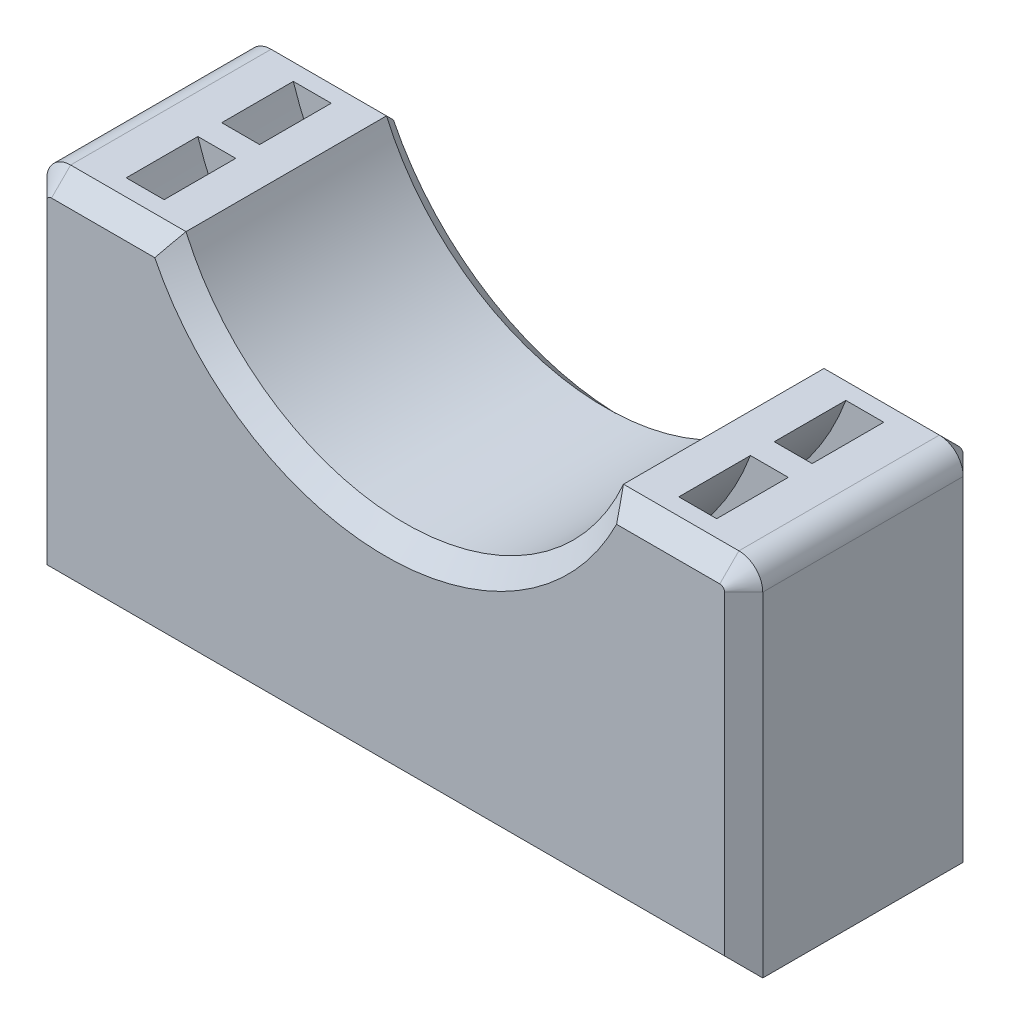
ISO-10303-21;
HEADER;
FILE_DESCRIPTION(('STEP AP214'),'2;1');
FILE_NAME('part.step','',(''),(''),'','','');
FILE_SCHEMA(('AUTOMOTIVE_DESIGN { 1 0 10303 214 1 1 1 1 }'));
ENDSEC;
DATA;
#1=APPLICATION_CONTEXT('core data for automotive mechanical design processes');
#2=APPLICATION_PROTOCOL_DEFINITION('international standard','automotive_design',2000,#1);
#3=PRODUCT_CONTEXT('',#1,'mechanical');
#4=PRODUCT('Part','Part','',(#3));
#5=PRODUCT_RELATED_PRODUCT_CATEGORY('part','',(#4));
#6=PRODUCT_DEFINITION_FORMATION('','',#4);
#7=PRODUCT_DEFINITION_CONTEXT('part definition',#1,'design');
#8=PRODUCT_DEFINITION('design','',#6,#7);
#9=PRODUCT_DEFINITION_SHAPE('','',#8);
#10=(LENGTH_UNIT() NAMED_UNIT(*) SI_UNIT(.MILLI.,.METRE.));
#11=(NAMED_UNIT(*) PLANE_ANGLE_UNIT() SI_UNIT($,.RADIAN.));
#12=(NAMED_UNIT(*) SI_UNIT($,.STERADIAN.) SOLID_ANGLE_UNIT());
#13=UNCERTAINTY_MEASURE_WITH_UNIT(LENGTH_MEASURE(1.E-05),#10,'distance_accuracy_value','');
#14=(GEOMETRIC_REPRESENTATION_CONTEXT(3) GLOBAL_UNCERTAINTY_ASSIGNED_CONTEXT((#13)) GLOBAL_UNIT_ASSIGNED_CONTEXT((#10,
#11,#12)) REPRESENTATION_CONTEXT('',''));
#15=CARTESIAN_POINT('',(0.,0.,0.));
#16=DIRECTION('',(0.,0.,1.));
#17=DIRECTION('',(1.,0.,0.));
#18=AXIS2_PLACEMENT_3D('',#15,#16,#17);
#19=CARTESIAN_POINT('',(0.,7.5,10.));
#20=DIRECTION('',(0.,1.,0.));
#21=DIRECTION('',(0.,0.,1.));
#22=AXIS2_PLACEMENT_3D('',#19,#20,#21);
#23=PLANE('',#22);
#24=DIRECTION('',(0.,0.,-1.));
#25=VECTOR('',#24,1.);
#26=CARTESIAN_POINT('',(-9.16515138991168,7.5,10.));
#27=LINE('',#26,#25);
#28=CARTESIAN_POINT('',(-9.16515138991168,7.5,9.19999999999999));
#29=VERTEX_POINT('',#28);
#30=CARTESIAN_POINT('',(-9.16515138991168,7.5,0.799999999999995));
#31=VERTEX_POINT('',#30);
#32=EDGE_CURVE('E215',#29,#31,#27,.T.);
#33=ORIENTED_EDGE('',*,*,#32,.T.);
#34=DIRECTION('',(-1.,0.,0.));
#35=VECTOR('',#34,1.);
#36=CARTESIAN_POINT('',(-14.,7.5,0.799999999999995));
#37=LINE('',#36,#35);
#38=CARTESIAN_POINT('',(-14.,7.5,0.799999999999995));
#39=VERTEX_POINT('',#38);
#40=EDGE_CURVE('E283',#31,#39,#37,.T.);
#41=ORIENTED_EDGE('',*,*,#40,.T.);
#42=DIRECTION('',(0.,0.,-1.));
#43=VECTOR('',#42,1.);
#44=CARTESIAN_POINT('',(-14.,7.5,10.));
#45=LINE('',#44,#43);
#46=CARTESIAN_POINT('',(-14.,7.5,9.19999999999999));
#47=VERTEX_POINT('',#46);
#48=EDGE_CURVE('E256',#39,#47,#45,.F.);
#49=ORIENTED_EDGE('',*,*,#48,.T.);
#50=DIRECTION('',(1.,0.,0.));
#51=VECTOR('',#50,1.);
#52=CARTESIAN_POINT('',(0.,7.5,9.19999999999999));
#53=LINE('',#52,#51);
#54=EDGE_CURVE('E281',#47,#29,#53,.T.);
#55=ORIENTED_EDGE('',*,*,#54,.T.);
#56=EDGE_LOOP('',(#33,#41,#49,#55));
#57=FACE_BOUND('',#56,.T.);
#58=DIRECTION('',(0.,0.,-1.));
#59=VECTOR('',#58,1.);
#60=CARTESIAN_POINT('',(-10.7819293264239,7.5,0.));
#61=LINE('',#60,#59);
#62=CARTESIAN_POINT('',(-10.7819293264239,7.5,1.5));
#63=VERTEX_POINT('',#62);
#64=CARTESIAN_POINT('',(-10.7819293264239,7.5,4.5));
#65=VERTEX_POINT('',#64);
#66=EDGE_CURVE('E520',#63,#65,#61,.F.);
#67=ORIENTED_EDGE('',*,*,#66,.T.);
#68=DIRECTION('',(-1.,0.,0.));
#69=VECTOR('',#68,1.);
#70=CARTESIAN_POINT('',(0.,7.5,4.5));
#71=LINE('',#70,#69);
#72=CARTESIAN_POINT('',(-12.369316876853,7.5,4.5));
#73=VERTEX_POINT('',#72);
#74=EDGE_CURVE('E223',#65,#73,#71,.T.);
#75=ORIENTED_EDGE('',*,*,#74,.T.);
#76=DIRECTION('',(0.,0.,-1.));
#77=VECTOR('',#76,1.);
#78=CARTESIAN_POINT('',(-12.369316876853,7.5,0.));
#79=LINE('',#78,#77);
#80=CARTESIAN_POINT('',(-12.369316876853,7.5,1.5));
#81=VERTEX_POINT('',#80);
#82=EDGE_CURVE('E524',#73,#81,#79,.T.);
#83=ORIENTED_EDGE('',*,*,#82,.T.);
#84=DIRECTION('',(1.,0.,0.));
#85=VECTOR('',#84,1.);
#86=CARTESIAN_POINT('',(0.,7.5,1.5));
#87=LINE('',#86,#85);
#88=EDGE_CURVE('E511',#81,#63,#87,.T.);
#89=ORIENTED_EDGE('',*,*,#88,.T.);
#90=EDGE_LOOP('',(#67,#75,#83,#89));
#91=FACE_BOUND('',#90,.T.);
#92=DIRECTION('',(0.,0.,-1.));
#93=VECTOR('',#92,1.);
#94=CARTESIAN_POINT('',(-10.7819293264239,7.5,0.));
#95=LINE('',#94,#93);
#96=CARTESIAN_POINT('',(-10.7819293264239,7.5,5.50000000000001));
#97=VERTEX_POINT('',#96);
#98=CARTESIAN_POINT('',(-10.7819293264239,7.5,8.50000000000001));
#99=VERTEX_POINT('',#98);
#100=EDGE_CURVE('E527',#97,#99,#95,.F.);
#101=ORIENTED_EDGE('',*,*,#100,.T.);
#102=DIRECTION('',(-1.,0.,0.));
#103=VECTOR('',#102,1.);
#104=CARTESIAN_POINT('',(0.,7.5,8.50000000000001));
#105=LINE('',#104,#103);
#106=CARTESIAN_POINT('',(-12.369316876853,7.5,8.50000000000001));
#107=VERTEX_POINT('',#106);
#108=EDGE_CURVE('E536',#99,#107,#105,.T.);
#109=ORIENTED_EDGE('',*,*,#108,.T.);
#110=DIRECTION('',(0.,0.,-1.));
#111=VECTOR('',#110,1.);
#112=CARTESIAN_POINT('',(-12.369316876853,7.5,0.));
#113=LINE('',#112,#111);
#114=CARTESIAN_POINT('',(-12.369316876853,7.5,5.50000000000001));
#115=VERTEX_POINT('',#114);
#116=EDGE_CURVE('E533',#107,#115,#113,.T.);
#117=ORIENTED_EDGE('',*,*,#116,.T.);
#118=DIRECTION('',(1.,0.,0.));
#119=VECTOR('',#118,1.);
#120=CARTESIAN_POINT('',(0.,7.5,5.50000000000001));
#121=LINE('',#120,#119);
#122=EDGE_CURVE('E530',#115,#97,#121,.T.);
#123=ORIENTED_EDGE('',*,*,#122,.T.);
#124=EDGE_LOOP('',(#101,#109,#117,#123));
#125=FACE_BOUND('',#124,.T.);
#126=ADVANCED_FACE('F37',(#57,#91,#125),#23,.T.);
#127=DIRECTION('',(0.,0.,-1.));
#128=VECTOR('',#127,1.);
#129=CARTESIAN_POINT('',(14.,7.5,0.));
#130=LINE('',#129,#128);
#131=CARTESIAN_POINT('',(14.,7.5,9.19999999999999));
#132=VERTEX_POINT('',#131);
#133=CARTESIAN_POINT('',(14.,7.5,0.799999999999995));
#134=VERTEX_POINT('',#133);
#135=EDGE_CURVE('E247',#132,#134,#130,.T.);
#136=ORIENTED_EDGE('',*,*,#135,.T.);
#137=DIRECTION('',(-1.,0.,0.));
#138=VECTOR('',#137,1.);
#139=CARTESIAN_POINT('',(9.16515138991168,7.5,0.799999999999995));
#140=LINE('',#139,#138);
#141=CARTESIAN_POINT('',(9.16515138991168,7.5,0.799999999999995));
#142=VERTEX_POINT('',#141);
#143=EDGE_CURVE('E308',#134,#142,#140,.T.);
#144=ORIENTED_EDGE('',*,*,#143,.T.);
#145=DIRECTION('',(0.,0.,-1.));
#146=VECTOR('',#145,1.);
#147=CARTESIAN_POINT('',(9.16515138991168,7.5,10.));
#148=LINE('',#147,#146);
#149=CARTESIAN_POINT('',(9.16515138991168,7.5,9.19999999999999));
#150=VERTEX_POINT('',#149);
#151=EDGE_CURVE('E496',#150,#142,#148,.T.);
#152=ORIENTED_EDGE('',*,*,#151,.F.);
#153=DIRECTION('',(1.,0.,0.));
#154=VECTOR('',#153,1.);
#155=CARTESIAN_POINT('',(0.,7.5,9.19999999999999));
#156=LINE('',#155,#154);
#157=EDGE_CURVE('E306',#150,#132,#156,.T.);
#158=ORIENTED_EDGE('',*,*,#157,.T.);
#159=EDGE_LOOP('',(#136,#144,#152,#158));
#160=FACE_BOUND('',#159,.T.);
#161=DIRECTION('',(0.,0.,-1.));
#162=VECTOR('',#161,1.);
#163=CARTESIAN_POINT('',(12.369316876853,7.5,0.));
#164=LINE('',#163,#162);
#165=CARTESIAN_POINT('',(12.369316876853,7.5,1.5));
#166=VERTEX_POINT('',#165);
#167=CARTESIAN_POINT('',(12.369316876853,7.5,4.5));
#168=VERTEX_POINT('',#167);
#169=EDGE_CURVE('E230',#166,#168,#164,.F.);
#170=ORIENTED_EDGE('',*,*,#169,.T.);
#171=DIRECTION('',(-1.,0.,0.));
#172=VECTOR('',#171,1.);
#173=CARTESIAN_POINT('',(0.,7.5,4.5));
#174=LINE('',#173,#172);
#175=CARTESIAN_POINT('',(10.7819293264239,7.5,4.5));
#176=VERTEX_POINT('',#175);
#177=EDGE_CURVE('E220',#168,#176,#174,.T.);
#178=ORIENTED_EDGE('',*,*,#177,.T.);
#179=DIRECTION('',(0.,0.,-1.));
#180=VECTOR('',#179,1.);
#181=CARTESIAN_POINT('',(10.7819293264239,7.5,0.));
#182=LINE('',#181,#180);
#183=CARTESIAN_POINT('',(10.7819293264239,7.5,1.5));
#184=VERTEX_POINT('',#183);
#185=EDGE_CURVE('E203',#176,#184,#182,.T.);
#186=ORIENTED_EDGE('',*,*,#185,.T.);
#187=DIRECTION('',(1.,0.,0.));
#188=VECTOR('',#187,1.);
#189=CARTESIAN_POINT('',(0.,7.5,1.5));
#190=LINE('',#189,#188);
#191=EDGE_CURVE('E214',#184,#166,#190,.T.);
#192=ORIENTED_EDGE('',*,*,#191,.T.);
#193=EDGE_LOOP('',(#170,#178,#186,#192));
#194=FACE_BOUND('',#193,.T.);
#195=DIRECTION('',(0.,0.,-1.));
#196=VECTOR('',#195,1.);
#197=CARTESIAN_POINT('',(12.369316876853,7.5,0.));
#198=LINE('',#197,#196);
#199=CARTESIAN_POINT('',(12.369316876853,7.5,5.50000000000001));
#200=VERTEX_POINT('',#199);
#201=CARTESIAN_POINT('',(12.369316876853,7.5,8.50000000000001));
#202=VERTEX_POINT('',#201);
#203=EDGE_CURVE('E241',#200,#202,#198,.F.);
#204=ORIENTED_EDGE('',*,*,#203,.T.);
#205=DIRECTION('',(-1.,0.,0.));
#206=VECTOR('',#205,1.);
#207=CARTESIAN_POINT('',(0.,7.5,8.50000000000001));
#208=LINE('',#207,#206);
#209=CARTESIAN_POINT('',(10.7819293264239,7.5,8.5));
#210=VERTEX_POINT('',#209);
#211=EDGE_CURVE('E244',#202,#210,#208,.T.);
#212=ORIENTED_EDGE('',*,*,#211,.T.);
#213=DIRECTION('',(0.,0.,-1.));
#214=VECTOR('',#213,1.);
#215=CARTESIAN_POINT('',(10.7819293264239,7.5,0.));
#216=LINE('',#215,#214);
#217=CARTESIAN_POINT('',(10.7819293264239,7.5,5.50000000000001));
#218=VERTEX_POINT('',#217);
#219=EDGE_CURVE('E231',#210,#218,#216,.T.);
#220=ORIENTED_EDGE('',*,*,#219,.T.);
#221=DIRECTION('',(1.,0.,0.));
#222=VECTOR('',#221,1.);
#223=CARTESIAN_POINT('',(0.,7.5,5.50000000000001));
#224=LINE('',#223,#222);
#225=EDGE_CURVE('E234',#218,#200,#224,.T.);
#226=ORIENTED_EDGE('',*,*,#225,.T.);
#227=EDGE_LOOP('',(#204,#212,#220,#226));
#228=FACE_BOUND('',#227,.T.);
#229=ADVANCED_FACE('F228',(#160,#194,#228),#23,.T.);
#230=CARTESIAN_POINT('',(0.,11.5,10.));
#231=DIRECTION('',(0.,0.,-1.));
#232=DIRECTION('',(-1.,0.,0.));
#233=AXIS2_PLACEMENT_3D('',#230,#231,#232);
#234=CYLINDRICAL_SURFACE('',#233,10.);
#235=ORIENTED_EDGE('',*,*,#151,.T.);
#236=CARTESIAN_POINT('',(0.,11.5,0.799999999999995));
#237=DIRECTION('',(0.,0.,1.));
#238=DIRECTION('',(1.,0.,0.));
#239=AXIS2_PLACEMENT_3D('',#236,#237,#238);
#240=CIRCLE('',#239,10.);
#241=EDGE_CURVE('E278',#142,#31,#240,.F.);
#242=ORIENTED_EDGE('',*,*,#241,.T.);
#243=ORIENTED_EDGE('',*,*,#32,.F.);
#244=CARTESIAN_POINT('',(0.,11.5,9.19999999999999));
#245=DIRECTION('',(0.,0.,1.));
#246=DIRECTION('',(1.,0.,0.));
#247=AXIS2_PLACEMENT_3D('',#244,#245,#246);
#248=CIRCLE('',#247,10.);
#249=EDGE_CURVE('E276',#29,#150,#248,.T.);
#250=ORIENTED_EDGE('',*,*,#249,.T.);
#251=EDGE_LOOP('',(#235,#242,#243,#250));
#252=FACE_BOUND('',#251,.T.);
#253=ADVANCED_FACE('F493',(#252),#234,.F.);
#254=CARTESIAN_POINT('',(-15.,0.,10.));
#255=DIRECTION('',(-1.,0.,0.));
#256=DIRECTION('',(0.,0.,1.));
#257=AXIS2_PLACEMENT_3D('',#254,#255,#256);
#258=PLANE('',#257);
#259=DIRECTION('',(0.,0.,-1.));
#260=VECTOR('',#259,1.);
#261=CARTESIAN_POINT('',(-15.,6.5,10.));
#262=LINE('',#261,#260);
#263=CARTESIAN_POINT('',(-15.,6.5,9.19999999999999));
#264=VERTEX_POINT('',#263);
#265=CARTESIAN_POINT('',(-15.,6.5,0.799999999999995));
#266=VERTEX_POINT('',#265);
#267=EDGE_CURVE('E253',#264,#266,#262,.T.);
#268=ORIENTED_EDGE('',*,*,#267,.T.);
#269=DIRECTION('',(0.,-1.,0.));
#270=VECTOR('',#269,1.);
#271=CARTESIAN_POINT('',(-15.,-7.5,0.799999999999995));
#272=LINE('',#271,#270);
#273=CARTESIAN_POINT('',(-15.,-7.5,0.799999999999995));
#274=VERTEX_POINT('',#273);
#275=EDGE_CURVE('E291',#266,#274,#272,.T.);
#276=ORIENTED_EDGE('',*,*,#275,.T.);
#277=DIRECTION('',(0.,0.,-1.));
#278=VECTOR('',#277,1.);
#279=CARTESIAN_POINT('',(-15.,-7.5,10.));
#280=LINE('',#279,#278);
#281=CARTESIAN_POINT('',(-15.,-7.5,9.19999999999999));
#282=VERTEX_POINT('',#281);
#283=EDGE_CURVE('E499',#282,#274,#280,.T.);
#284=ORIENTED_EDGE('',*,*,#283,.F.);
#285=DIRECTION('',(0.,1.,0.));
#286=VECTOR('',#285,1.);
#287=CARTESIAN_POINT('',(-15.,0.,9.19999999999999));
#288=LINE('',#287,#286);
#289=EDGE_CURVE('E289',#282,#264,#288,.T.);
#290=ORIENTED_EDGE('',*,*,#289,.T.);
#291=EDGE_LOOP('',(#268,#276,#284,#290));
#292=FACE_BOUND('',#291,.T.);
#293=ADVANCED_FACE('F586',(#292),#258,.T.);
#294=CARTESIAN_POINT('',(0.,-7.5,10.));
#295=DIRECTION('',(0.,1.,0.));
#296=DIRECTION('',(0.,0.,1.));
#297=AXIS2_PLACEMENT_3D('',#294,#295,#296);
#298=PLANE('',#297);
#299=CARTESIAN_POINT('',(-8.,-7.5,5.));
#300=DIRECTION('',(0.,-1.,0.));
#301=DIRECTION('',(0.,0.,-1.));
#302=AXIS2_PLACEMENT_3D('',#299,#300,#301);
#303=CIRCLE('',#302,1.4);
#304=CARTESIAN_POINT('',(-8.,-7.5,3.6));
#305=VERTEX_POINT('',#304);
#306=EDGE_CURVE('E543',#305,#305,#303,.T.);
#307=ORIENTED_EDGE('',*,*,#306,.F.);
#308=EDGE_LOOP('',(#307));
#309=FACE_BOUND('',#308,.T.);
#310=CARTESIAN_POINT('',(8.,-7.5,5.));
#311=DIRECTION('',(0.,-1.,0.));
#312=DIRECTION('',(0.,0.,1.));
#313=AXIS2_PLACEMENT_3D('',#310,#311,#312);
#314=CIRCLE('',#313,1.4);
#315=CARTESIAN_POINT('',(8.,-7.5,6.4));
#316=VERTEX_POINT('',#315);
#317=EDGE_CURVE('E539',#316,#316,#314,.T.);
#318=ORIENTED_EDGE('',*,*,#317,.F.);
#319=EDGE_LOOP('',(#318));
#320=FACE_BOUND('',#319,.T.);
#321=ORIENTED_EDGE('',*,*,#283,.T.);
#322=DIRECTION('',(1.,0.,0.));
#323=VECTOR('',#322,1.);
#324=CARTESIAN_POINT('',(0.,-7.5,0.799999999999995));
#325=LINE('',#324,#323);
#326=CARTESIAN_POINT('',(15.,-7.5,0.799999999999995));
#327=VERTEX_POINT('',#326);
#328=EDGE_CURVE('E296',#274,#327,#325,.T.);
#329=ORIENTED_EDGE('',*,*,#328,.T.);
#330=DIRECTION('',(0.,0.,-1.));
#331=VECTOR('',#330,1.);
#332=CARTESIAN_POINT('',(15.,-7.5,10.));
#333=LINE('',#332,#331);
#334=CARTESIAN_POINT('',(15.,-7.5,9.19999999999999));
#335=VERTEX_POINT('',#334);
#336=EDGE_CURVE('E502',#335,#327,#333,.T.);
#337=ORIENTED_EDGE('',*,*,#336,.F.);
#338=DIRECTION('',(-1.,0.,0.));
#339=VECTOR('',#338,1.);
#340=CARTESIAN_POINT('',(-15.,-7.5,9.19999999999999));
#341=LINE('',#340,#339);
#342=EDGE_CURVE('E293',#335,#282,#341,.T.);
#343=ORIENTED_EDGE('',*,*,#342,.T.);
#344=EDGE_LOOP('',(#321,#329,#337,#343));
#345=FACE_BOUND('',#344,.T.);
#346=ADVANCED_FACE('F584',(#309,#320,#345),#298,.F.);
#347=CARTESIAN_POINT('',(15.,0.,10.));
#348=DIRECTION('',(-1.,0.,0.));
#349=DIRECTION('',(0.,0.,1.));
#350=AXIS2_PLACEMENT_3D('',#347,#348,#349);
#351=PLANE('',#350);
#352=ORIENTED_EDGE('',*,*,#336,.T.);
#353=DIRECTION('',(0.,1.,0.));
#354=VECTOR('',#353,1.);
#355=CARTESIAN_POINT('',(15.,0.,0.799999999999995));
#356=LINE('',#355,#354);
#357=CARTESIAN_POINT('',(15.,6.5,0.799999999999995));
#358=VERTEX_POINT('',#357);
#359=EDGE_CURVE('E300',#327,#358,#356,.T.);
#360=ORIENTED_EDGE('',*,*,#359,.T.);
#361=DIRECTION('',(0.,0.,-1.));
#362=VECTOR('',#361,1.);
#363=CARTESIAN_POINT('',(15.,6.5,10.));
#364=LINE('',#363,#362);
#365=CARTESIAN_POINT('',(15.,6.5,9.19999999999999));
#366=VERTEX_POINT('',#365);
#367=EDGE_CURVE('E250',#358,#366,#364,.F.);
#368=ORIENTED_EDGE('',*,*,#367,.T.);
#369=DIRECTION('',(0.,-1.,0.));
#370=VECTOR('',#369,1.);
#371=CARTESIAN_POINT('',(15.,-7.5,9.19999999999999));
#372=LINE('',#371,#370);
#373=EDGE_CURVE('E298',#366,#335,#372,.T.);
#374=ORIENTED_EDGE('',*,*,#373,.T.);
#375=EDGE_LOOP('',(#352,#360,#368,#374));
#376=FACE_BOUND('',#375,.T.);
#377=ADVANCED_FACE('F555',(#376),#351,.F.);
#378=CARTESIAN_POINT('',(0.,0.,10.));
#379=DIRECTION('',(0.,0.,1.));
#380=DIRECTION('',(1.,0.,0.));
#381=AXIS2_PLACEMENT_3D('',#378,#379,#380);
#382=PLANE('',#381);
#383=DIRECTION('',(0.,-1.,0.));
#384=VECTOR('',#383,1.);
#385=CARTESIAN_POINT('',(-14.2,0.,10.));
#386=LINE('',#385,#384);
#387=CARTESIAN_POINT('',(-14.2,6.5,10.));
#388=VERTEX_POINT('',#387);
#389=CARTESIAN_POINT('',(-14.2,-6.7,10.));
#390=VERTEX_POINT('',#389);
#391=EDGE_CURVE('E52',#388,#390,#386,.T.);
#392=ORIENTED_EDGE('',*,*,#391,.T.);
#393=DIRECTION('',(1.,0.,0.));
#394=VECTOR('',#393,1.);
#395=CARTESIAN_POINT('',(15.,-6.7,10.));
#396=LINE('',#395,#394);
#397=CARTESIAN_POINT('',(14.2,-6.7,10.));
#398=VERTEX_POINT('',#397);
#399=EDGE_CURVE('E11',#390,#398,#396,.T.);
#400=ORIENTED_EDGE('',*,*,#399,.T.);
#401=DIRECTION('',(0.,1.,0.));
#402=VECTOR('',#401,1.);
#403=CARTESIAN_POINT('',(14.2,6.5,10.));
#404=LINE('',#403,#402);
#405=CARTESIAN_POINT('',(14.2,6.5,10.));
#406=VERTEX_POINT('',#405);
#407=EDGE_CURVE('E310',#398,#406,#404,.T.);
#408=ORIENTED_EDGE('',*,*,#407,.T.);
#409=CARTESIAN_POINT('',(14.,6.5,10.));
#410=DIRECTION('',(0.,0.,1.));
#411=DIRECTION('',(1.,0.,0.));
#412=AXIS2_PLACEMENT_3D('',#409,#410,#411);
#413=CIRCLE('',#412,0.199999999999999);
#414=CARTESIAN_POINT('',(14.,6.7,10.));
#415=VERTEX_POINT('',#414);
#416=EDGE_CURVE('E312',#406,#415,#413,.T.);
#417=ORIENTED_EDGE('',*,*,#416,.T.);
#418=DIRECTION('',(-1.,0.,0.));
#419=VECTOR('',#418,1.);
#420=CARTESIAN_POINT('',(0.,6.7,10.));
#421=LINE('',#420,#419);
#422=CARTESIAN_POINT('',(9.67470929795827,6.7,10.));
#423=VERTEX_POINT('',#422);
#424=EDGE_CURVE('E314',#415,#423,#421,.T.);
#425=ORIENTED_EDGE('',*,*,#424,.T.);
#426=CARTESIAN_POINT('',(0.,11.5,10.));
#427=DIRECTION('',(0.,0.,1.));
#428=DIRECTION('',(1.,0.,0.));
#429=AXIS2_PLACEMENT_3D('',#426,#427,#428);
#430=CIRCLE('',#429,10.8);
#431=CARTESIAN_POINT('',(-9.67470929795827,6.70000000000002,10.));
#432=VERTEX_POINT('',#431);
#433=EDGE_CURVE('E316',#423,#432,#430,.F.);
#434=ORIENTED_EDGE('',*,*,#433,.T.);
#435=DIRECTION('',(-1.,0.,0.));
#436=VECTOR('',#435,1.);
#437=CARTESIAN_POINT('',(0.,6.7,10.));
#438=LINE('',#437,#436);
#439=CARTESIAN_POINT('',(-14.,6.7,10.));
#440=VERTEX_POINT('',#439);
#441=EDGE_CURVE('E318',#432,#440,#438,.T.);
#442=ORIENTED_EDGE('',*,*,#441,.T.);
#443=CARTESIAN_POINT('',(-14.,6.5,10.));
#444=DIRECTION('',(0.,0.,1.));
#445=DIRECTION('',(1.,0.,0.));
#446=AXIS2_PLACEMENT_3D('',#443,#444,#445);
#447=CIRCLE('',#446,0.199999999999997);
#448=EDGE_CURVE('E63',#440,#388,#447,.T.);
#449=ORIENTED_EDGE('',*,*,#448,.T.);
#450=EDGE_LOOP('',(#392,#400,#408,#417,#425,#434,#442,#449));
#451=FACE_BOUND('',#450,.T.);
#452=ADVANCED_FACE('F609',(#451),#382,.T.);
#453=CARTESIAN_POINT('',(0.,0.,0.));
#454=DIRECTION('',(0.,0.,1.));
#455=DIRECTION('',(1.,0.,0.));
#456=AXIS2_PLACEMENT_3D('',#453,#454,#455);
#457=PLANE('',#456);
#458=DIRECTION('',(1.,0.,0.));
#459=VECTOR('',#458,1.);
#460=CARTESIAN_POINT('',(-9.16515138991168,6.7,0.));
#461=LINE('',#460,#459);
#462=CARTESIAN_POINT('',(-14.,6.7,0.));
#463=VERTEX_POINT('',#462);
#464=CARTESIAN_POINT('',(-9.67470929795827,6.7,0.));
#465=VERTEX_POINT('',#464);
#466=EDGE_CURVE('E271',#463,#465,#461,.T.);
#467=ORIENTED_EDGE('',*,*,#466,.T.);
#468=CARTESIAN_POINT('',(0.,11.5,0.));
#469=DIRECTION('',(0.,0.,1.));
#470=DIRECTION('',(1.,0.,0.));
#471=AXIS2_PLACEMENT_3D('',#468,#469,#470);
#472=CIRCLE('',#471,10.8);
#473=CARTESIAN_POINT('',(9.67470929795827,6.7,0.));
#474=VERTEX_POINT('',#473);
#475=EDGE_CURVE('E273',#465,#474,#472,.T.);
#476=ORIENTED_EDGE('',*,*,#475,.T.);
#477=DIRECTION('',(1.,0.,0.));
#478=VECTOR('',#477,1.);
#479=CARTESIAN_POINT('',(14.,6.7,0.));
#480=LINE('',#479,#478);
#481=CARTESIAN_POINT('',(14.,6.7,0.));
#482=VERTEX_POINT('',#481);
#483=EDGE_CURVE('E259',#474,#482,#480,.T.);
#484=ORIENTED_EDGE('',*,*,#483,.T.);
#485=CARTESIAN_POINT('',(14.,6.5,0.));
#486=DIRECTION('',(0.,0.,1.));
#487=DIRECTION('',(1.,0.,0.));
#488=AXIS2_PLACEMENT_3D('',#485,#486,#487);
#489=CIRCLE('',#488,0.200000000000002);
#490=CARTESIAN_POINT('',(14.2,6.5,0.));
#491=VERTEX_POINT('',#490);
#492=EDGE_CURVE('E261',#482,#491,#489,.F.);
#493=ORIENTED_EDGE('',*,*,#492,.T.);
#494=DIRECTION('',(0.,-1.,0.));
#495=VECTOR('',#494,1.);
#496=CARTESIAN_POINT('',(14.2,0.,0.));
#497=LINE('',#496,#495);
#498=CARTESIAN_POINT('',(14.2,-6.7,0.));
#499=VERTEX_POINT('',#498);
#500=EDGE_CURVE('E263',#491,#499,#497,.T.);
#501=ORIENTED_EDGE('',*,*,#500,.T.);
#502=DIRECTION('',(-1.,0.,0.));
#503=VECTOR('',#502,1.);
#504=CARTESIAN_POINT('',(0.,-6.7,0.));
#505=LINE('',#504,#503);
#506=CARTESIAN_POINT('',(-14.2,-6.7,0.));
#507=VERTEX_POINT('',#506);
#508=EDGE_CURVE('E265',#499,#507,#505,.T.);
#509=ORIENTED_EDGE('',*,*,#508,.T.);
#510=DIRECTION('',(0.,1.,0.));
#511=VECTOR('',#510,1.);
#512=CARTESIAN_POINT('',(-14.2,6.5,0.));
#513=LINE('',#512,#511);
#514=CARTESIAN_POINT('',(-14.2,6.5,0.));
#515=VERTEX_POINT('',#514);
#516=EDGE_CURVE('E267',#507,#515,#513,.T.);
#517=ORIENTED_EDGE('',*,*,#516,.T.);
#518=CARTESIAN_POINT('',(-14.,6.5,0.));
#519=DIRECTION('',(0.,0.,1.));
#520=DIRECTION('',(1.,0.,0.));
#521=AXIS2_PLACEMENT_3D('',#518,#519,#520);
#522=CIRCLE('',#521,0.200000000000001);
#523=EDGE_CURVE('E269',#515,#463,#522,.F.);
#524=ORIENTED_EDGE('',*,*,#523,.T.);
#525=EDGE_LOOP('',(#467,#476,#484,#493,#501,#509,#517,#524));
#526=FACE_BOUND('',#525,.T.);
#527=ADVANCED_FACE('F594',(#526),#457,.F.);
#528=CARTESIAN_POINT('',(8.,-1.5,5.));
#529=DIRECTION('',(0.,-1.,0.));
#530=DIRECTION('',(0.,0.,-1.));
#531=AXIS2_PLACEMENT_3D('',#528,#529,#530);
#532=CYLINDRICAL_SURFACE('',#531,1.4);
#533=CARTESIAN_POINT('',(8.,-1.5,5.));
#534=DIRECTION('',(0.,-1.,0.));
#535=DIRECTION('',(0.,0.,1.));
#536=AXIS2_PLACEMENT_3D('',#533,#534,#535);
#537=CIRCLE('',#536,1.4);
#538=CARTESIAN_POINT('',(8.,-1.5,6.4));
#539=VERTEX_POINT('',#538);
#540=EDGE_CURVE('E546',#539,#539,#537,.T.);
#541=ORIENTED_EDGE('',*,*,#540,.F.);
#542=EDGE_LOOP('',(#541));
#543=FACE_BOUND('',#542,.T.);
#544=ORIENTED_EDGE('',*,*,#317,.T.);
#545=EDGE_LOOP('',(#544));
#546=FACE_BOUND('',#545,.T.);
#547=ADVANCED_FACE('F635',(#543,#546),#532,.F.);
#548=CARTESIAN_POINT('',(8.,-1.5,5.));
#549=DIRECTION('',(0.,1.,0.));
#550=DIRECTION('',(0.,0.,1.));
#551=AXIS2_PLACEMENT_3D('',#548,#549,#550);
#552=PLANE('',#551);
#553=ORIENTED_EDGE('',*,*,#540,.T.);
#554=EDGE_LOOP('',(#553));
#555=FACE_BOUND('',#554,.T.);
#556=ADVANCED_FACE('F639',(#555),#552,.F.);
#557=CARTESIAN_POINT('',(-8.,-1.5,5.));
#558=DIRECTION('',(0.,-1.,0.));
#559=DIRECTION('',(0.,0.,-1.));
#560=AXIS2_PLACEMENT_3D('',#557,#558,#559);
#561=CYLINDRICAL_SURFACE('',#560,1.4);
#562=CARTESIAN_POINT('',(-8.,-1.5,5.));
#563=DIRECTION('',(0.,-1.,0.));
#564=DIRECTION('',(0.,0.,-1.));
#565=AXIS2_PLACEMENT_3D('',#562,#563,#564);
#566=CIRCLE('',#565,1.4);
#567=CARTESIAN_POINT('',(-8.,-1.5,3.6));
#568=VERTEX_POINT('',#567);
#569=EDGE_CURVE('E540',#568,#568,#566,.T.);
#570=ORIENTED_EDGE('',*,*,#569,.F.);
#571=EDGE_LOOP('',(#570));
#572=FACE_BOUND('',#571,.T.);
#573=ORIENTED_EDGE('',*,*,#306,.T.);
#574=EDGE_LOOP('',(#573));
#575=FACE_BOUND('',#574,.T.);
#576=ADVANCED_FACE('F643',(#572,#575),#561,.F.);
#577=CARTESIAN_POINT('',(-8.,-1.5,5.));
#578=DIRECTION('',(0.,-1.,0.));
#579=DIRECTION('',(0.,0.,-1.));
#580=AXIS2_PLACEMENT_3D('',#577,#578,#579);
#581=PLANE('',#580);
#582=ORIENTED_EDGE('',*,*,#569,.T.);
#583=EDGE_LOOP('',(#582));
#584=FACE_BOUND('',#583,.T.);
#585=ADVANCED_FACE('F647',(#584),#581,.T.);
#586=CARTESIAN_POINT('',(0.,0.,4.5));
#587=DIRECTION('',(0.,0.,-1.));
#588=DIRECTION('',(0.,1.,0.));
#589=AXIS2_PLACEMENT_3D('',#586,#587,#588);
#590=PLANE('',#589);
#591=CARTESIAN_POINT('',(0.,11.5,4.5));
#592=DIRECTION('',(0.,0.,-1.));
#593=DIRECTION('',(0.,1.,0.));
#594=AXIS2_PLACEMENT_3D('',#591,#592,#593);
#595=CIRCLE('',#594,11.5);
#596=EDGE_CURVE('E206',#176,#65,#595,.T.);
#597=ORIENTED_EDGE('',*,*,#596,.F.);
#598=ORIENTED_EDGE('',*,*,#177,.F.);
#599=CARTESIAN_POINT('',(0.,11.5,4.5));
#600=DIRECTION('',(0.,0.,-1.));
#601=DIRECTION('',(0.,1.,0.));
#602=AXIS2_PLACEMENT_3D('',#599,#600,#601);
#603=CIRCLE('',#602,13.);
#604=EDGE_CURVE('E514',#168,#73,#603,.T.);
#605=ORIENTED_EDGE('',*,*,#604,.T.);
#606=ORIENTED_EDGE('',*,*,#74,.F.);
#607=EDGE_LOOP('',(#597,#598,#605,#606));
#608=FACE_BOUND('',#607,.T.);
#609=ADVANCED_FACE('F218',(#608),#590,.T.);
#610=CARTESIAN_POINT('',(0.,11.5,0.));
#611=DIRECTION('',(0.,0.,-1.));
#612=DIRECTION('',(0.,1.,0.));
#613=AXIS2_PLACEMENT_3D('',#610,#611,#612);
#614=CYLINDRICAL_SURFACE('',#613,13.);
#615=ORIENTED_EDGE('',*,*,#604,.F.);
#616=ORIENTED_EDGE('',*,*,#169,.F.);
#617=CARTESIAN_POINT('',(0.,11.5,1.5));
#618=DIRECTION('',(0.,0.,-1.));
#619=DIRECTION('',(0.,1.,0.));
#620=AXIS2_PLACEMENT_3D('',#617,#618,#619);
#621=CIRCLE('',#620,13.);
#622=EDGE_CURVE('E510',#166,#81,#621,.T.);
#623=ORIENTED_EDGE('',*,*,#622,.T.);
#624=ORIENTED_EDGE('',*,*,#82,.F.);
#625=EDGE_LOOP('',(#615,#616,#623,#624));
#626=FACE_BOUND('',#625,.T.);
#627=ADVANCED_FACE('F654',(#626),#614,.F.);
#628=CARTESIAN_POINT('',(0.,0.,1.5));
#629=DIRECTION('',(0.,0.,1.));
#630=DIRECTION('',(0.,-1.,0.));
#631=AXIS2_PLACEMENT_3D('',#628,#629,#630);
#632=PLANE('',#631);
#633=ORIENTED_EDGE('',*,*,#622,.F.);
#634=ORIENTED_EDGE('',*,*,#191,.F.);
#635=CARTESIAN_POINT('',(0.,11.5,1.5));
#636=DIRECTION('',(0.,0.,-1.));
#637=DIRECTION('',(0.,1.,0.));
#638=AXIS2_PLACEMENT_3D('',#635,#636,#637);
#639=CIRCLE('',#638,11.5);
#640=EDGE_CURVE('E209',#184,#63,#639,.T.);
#641=ORIENTED_EDGE('',*,*,#640,.T.);
#642=ORIENTED_EDGE('',*,*,#88,.F.);
#643=EDGE_LOOP('',(#633,#634,#641,#642));
#644=FACE_BOUND('',#643,.T.);
#645=ADVANCED_FACE('F507',(#644),#632,.T.);
#646=CARTESIAN_POINT('',(0.,11.5,0.));
#647=DIRECTION('',(0.,0.,-1.));
#648=DIRECTION('',(0.,1.,0.));
#649=AXIS2_PLACEMENT_3D('',#646,#647,#648);
#650=CYLINDRICAL_SURFACE('',#649,11.5);
#651=ORIENTED_EDGE('',*,*,#640,.F.);
#652=ORIENTED_EDGE('',*,*,#185,.F.);
#653=ORIENTED_EDGE('',*,*,#596,.T.);
#654=ORIENTED_EDGE('',*,*,#66,.F.);
#655=EDGE_LOOP('',(#651,#652,#653,#654));
#656=FACE_BOUND('',#655,.T.);
#657=ADVANCED_FACE('F205',(#656),#650,.T.);
#658=CARTESIAN_POINT('',(0.,0.,8.5));
#659=DIRECTION('',(0.,0.,-1.));
#660=DIRECTION('',(0.,1.,0.));
#661=AXIS2_PLACEMENT_3D('',#658,#659,#660);
#662=PLANE('',#661);
#663=CARTESIAN_POINT('',(0.,11.5,8.5));
#664=DIRECTION('',(0.,0.,-1.));
#665=DIRECTION('',(0.,1.,0.));
#666=AXIS2_PLACEMENT_3D('',#663,#664,#665);
#667=CIRCLE('',#666,11.5);
#668=EDGE_CURVE('E516',#210,#99,#667,.T.);
#669=ORIENTED_EDGE('',*,*,#668,.F.);
#670=ORIENTED_EDGE('',*,*,#211,.F.);
#671=CARTESIAN_POINT('',(0.,11.5,8.50000000000001));
#672=DIRECTION('',(0.,0.,-1.));
#673=DIRECTION('',(0.,1.,0.));
#674=AXIS2_PLACEMENT_3D('',#671,#672,#673);
#675=CIRCLE('',#674,13.);
#676=EDGE_CURVE('E522',#202,#107,#675,.T.);
#677=ORIENTED_EDGE('',*,*,#676,.T.);
#678=ORIENTED_EDGE('',*,*,#108,.F.);
#679=EDGE_LOOP('',(#669,#670,#677,#678));
#680=FACE_BOUND('',#679,.T.);
#681=ADVANCED_FACE('F661',(#680),#662,.T.);
#682=CARTESIAN_POINT('',(0.,11.5,0.));
#683=DIRECTION('',(0.,0.,-1.));
#684=DIRECTION('',(0.,1.,0.));
#685=AXIS2_PLACEMENT_3D('',#682,#683,#684);
#686=CYLINDRICAL_SURFACE('',#685,13.);
#687=ORIENTED_EDGE('',*,*,#676,.F.);
#688=ORIENTED_EDGE('',*,*,#203,.F.);
#689=CARTESIAN_POINT('',(0.,11.5,5.50000000000001));
#690=DIRECTION('',(0.,0.,-1.));
#691=DIRECTION('',(0.,1.,0.));
#692=AXIS2_PLACEMENT_3D('',#689,#690,#691);
#693=CIRCLE('',#692,13.);
#694=EDGE_CURVE('E680',#200,#115,#693,.T.);
#695=ORIENTED_EDGE('',*,*,#694,.T.);
#696=ORIENTED_EDGE('',*,*,#116,.F.);
#697=EDGE_LOOP('',(#687,#688,#695,#696));
#698=FACE_BOUND('',#697,.T.);
#699=ADVANCED_FACE('F664',(#698),#686,.F.);
#700=CARTESIAN_POINT('',(0.,0.,5.5));
#701=DIRECTION('',(0.,0.,1.));
#702=DIRECTION('',(0.,-1.,0.));
#703=AXIS2_PLACEMENT_3D('',#700,#701,#702);
#704=PLANE('',#703);
#705=ORIENTED_EDGE('',*,*,#694,.F.);
#706=ORIENTED_EDGE('',*,*,#225,.F.);
#707=CARTESIAN_POINT('',(0.,11.5,5.50000000000001));
#708=DIRECTION('',(0.,0.,-1.));
#709=DIRECTION('',(0.,1.,0.));
#710=AXIS2_PLACEMENT_3D('',#707,#708,#709);
#711=CIRCLE('',#710,11.5);
#712=EDGE_CURVE('E677',#218,#97,#711,.T.);
#713=ORIENTED_EDGE('',*,*,#712,.T.);
#714=ORIENTED_EDGE('',*,*,#122,.F.);
#715=EDGE_LOOP('',(#705,#706,#713,#714));
#716=FACE_BOUND('',#715,.T.);
#717=ADVANCED_FACE('F668',(#716),#704,.T.);
#718=CARTESIAN_POINT('',(0.,11.5,0.));
#719=DIRECTION('',(0.,0.,-1.));
#720=DIRECTION('',(0.,1.,0.));
#721=AXIS2_PLACEMENT_3D('',#718,#719,#720);
#722=CYLINDRICAL_SURFACE('',#721,11.5);
#723=ORIENTED_EDGE('',*,*,#712,.F.);
#724=ORIENTED_EDGE('',*,*,#219,.F.);
#725=ORIENTED_EDGE('',*,*,#668,.T.);
#726=ORIENTED_EDGE('',*,*,#100,.F.);
#727=EDGE_LOOP('',(#723,#724,#725,#726));
#728=FACE_BOUND('',#727,.T.);
#729=ADVANCED_FACE('F618',(#728),#722,.T.);
#730=CARTESIAN_POINT('',(14.,6.5,10.));
#731=DIRECTION('',(0.,0.,1.));
#732=DIRECTION('',(1.,0.,0.));
#733=AXIS2_PLACEMENT_3D('',#730,#731,#732);
#734=CYLINDRICAL_SURFACE('',#733,1.);
#735=ORIENTED_EDGE('',*,*,#367,.F.);
#736=CARTESIAN_POINT('',(14.,6.5,0.799999999999995));
#737=DIRECTION('',(0.,0.,1.));
#738=DIRECTION('',(1.,0.,0.));
#739=AXIS2_PLACEMENT_3D('',#736,#737,#738);
#740=CIRCLE('',#739,1.);
#741=EDGE_CURVE('E304',#358,#134,#740,.T.);
#742=ORIENTED_EDGE('',*,*,#741,.T.);
#743=ORIENTED_EDGE('',*,*,#135,.F.);
#744=CARTESIAN_POINT('',(14.,6.5,9.19999999999999));
#745=DIRECTION('',(0.,0.,1.));
#746=DIRECTION('',(1.,0.,0.));
#747=AXIS2_PLACEMENT_3D('',#744,#745,#746);
#748=CIRCLE('',#747,1.);
#749=EDGE_CURVE('E302',#132,#366,#748,.F.);
#750=ORIENTED_EDGE('',*,*,#749,.T.);
#751=EDGE_LOOP('',(#735,#742,#743,#750));
#752=FACE_BOUND('',#751,.T.);
#753=ADVANCED_FACE('F570',(#752),#734,.T.);
#754=CARTESIAN_POINT('',(-14.,6.5,10.));
#755=DIRECTION('',(0.,0.,-1.));
#756=DIRECTION('',(-1.,0.,0.));
#757=AXIS2_PLACEMENT_3D('',#754,#755,#756);
#758=CYLINDRICAL_SURFACE('',#757,1.);
#759=ORIENTED_EDGE('',*,*,#48,.F.);
#760=CARTESIAN_POINT('',(-14.,6.5,0.799999999999995));
#761=DIRECTION('',(0.,0.,1.));
#762=DIRECTION('',(1.,0.,0.));
#763=AXIS2_PLACEMENT_3D('',#760,#761,#762);
#764=CIRCLE('',#763,1.);
#765=EDGE_CURVE('E287',#39,#266,#764,.T.);
#766=ORIENTED_EDGE('',*,*,#765,.T.);
#767=ORIENTED_EDGE('',*,*,#267,.F.);
#768=CARTESIAN_POINT('',(-14.,6.5,9.19999999999999));
#769=DIRECTION('',(0.,0.,1.));
#770=DIRECTION('',(1.,0.,0.));
#771=AXIS2_PLACEMENT_3D('',#768,#769,#770);
#772=CIRCLE('',#771,1.);
#773=EDGE_CURVE('E285',#264,#47,#772,.F.);
#774=ORIENTED_EDGE('',*,*,#773,.T.);
#775=EDGE_LOOP('',(#759,#766,#767,#774));
#776=FACE_BOUND('',#775,.T.);
#777=ADVANCED_FACE('F392',(#776),#758,.T.);
#778=CARTESIAN_POINT('',(0.,-7.5,0.799999999999995));
#779=DIRECTION('',(0.,0.707106781186546,0.707106781186549));
#780=DIRECTION('',(1.,0.,0.));
#781=AXIS2_PLACEMENT_3D('',#778,#779,#780);
#782=PLANE('',#781);
#783=DIRECTION('',(-0.577350269189627,0.577350269189627,-0.577350269189624));
#784=VECTOR('',#783,1.);
#785=CARTESIAN_POINT('',(12.5,-4.99999999999999,-1.7));
#786=LINE('',#785,#784);
#787=EDGE_CURVE('E463',#327,#499,#786,.T.);
#788=ORIENTED_EDGE('',*,*,#787,.F.);
#789=ORIENTED_EDGE('',*,*,#328,.F.);
#790=DIRECTION('',(-0.577350269189627,-0.577350269189627,0.577350269189624));
#791=VECTOR('',#790,1.);
#792=CARTESIAN_POINT('',(-9.99999999999998,-2.49999999999999,-4.2));
#793=LINE('',#792,#791);
#794=EDGE_CURVE('E225',#507,#274,#793,.T.);
#795=ORIENTED_EDGE('',*,*,#794,.F.);
#796=ORIENTED_EDGE('',*,*,#508,.F.);
#797=EDGE_LOOP('',(#788,#789,#795,#796));
#798=FACE_BOUND('',#797,.T.);
#799=ADVANCED_FACE('F386',(#798),#782,.F.);
#800=CARTESIAN_POINT('',(-14.2,0.,0.));
#801=DIRECTION('',(-0.707106781186546,0.,-0.707106781186549));
#802=DIRECTION('',(0.,-1.,0.));
#803=AXIS2_PLACEMENT_3D('',#800,#801,#802);
#804=PLANE('',#803);
#805=ORIENTED_EDGE('',*,*,#794,.T.);
#806=ORIENTED_EDGE('',*,*,#275,.F.);
#807=DIRECTION('',(-0.707106781186549,0.,0.707106781186546));
#808=VECTOR('',#807,1.);
#809=CARTESIAN_POINT('',(-14.2,6.5,0.));
#810=LINE('',#809,#808);
#811=EDGE_CURVE('E466',#515,#266,#810,.T.);
#812=ORIENTED_EDGE('',*,*,#811,.F.);
#813=ORIENTED_EDGE('',*,*,#516,.F.);
#814=EDGE_LOOP('',(#805,#806,#812,#813));
#815=FACE_BOUND('',#814,.T.);
#816=ADVANCED_FACE('F379',(#815),#804,.T.);
#817=CARTESIAN_POINT('',(15.,0.,0.799999999999995));
#818=DIRECTION('',(-0.707106781186546,0.,0.707106781186549));
#819=DIRECTION('',(0.,1.,0.));
#820=AXIS2_PLACEMENT_3D('',#817,#818,#819);
#821=PLANE('',#820);
#822=ORIENTED_EDGE('',*,*,#787,.T.);
#823=ORIENTED_EDGE('',*,*,#500,.F.);
#824=DIRECTION('',(-0.707106781186549,0.,-0.707106781186546));
#825=VECTOR('',#824,1.);
#826=CARTESIAN_POINT('',(15.,6.5,0.799999999999995));
#827=LINE('',#826,#825);
#828=EDGE_CURVE('E469',#358,#491,#827,.T.);
#829=ORIENTED_EDGE('',*,*,#828,.F.);
#830=ORIENTED_EDGE('',*,*,#359,.F.);
#831=EDGE_LOOP('',(#822,#823,#829,#830));
#832=FACE_BOUND('',#831,.T.);
#833=ADVANCED_FACE('F372',(#832),#821,.F.);
#834=CARTESIAN_POINT('',(-14.,6.5,0.));
#835=DIRECTION('',(0.,0.,1.));
#836=DIRECTION('',(1.,0.,0.));
#837=AXIS2_PLACEMENT_3D('',#834,#835,#836);
#838=CONICAL_SURFACE('',#837,0.200000000000001,0.78539816339745);
#839=ORIENTED_EDGE('',*,*,#811,.T.);
#840=ORIENTED_EDGE('',*,*,#765,.F.);
#841=DIRECTION('',(0.,0.707106781186549,0.707106781186546));
#842=VECTOR('',#841,1.);
#843=CARTESIAN_POINT('',(-14.,6.7,0.));
#844=LINE('',#843,#842);
#845=EDGE_CURVE('E472',#463,#39,#844,.T.);
#846=ORIENTED_EDGE('',*,*,#845,.F.);
#847=ORIENTED_EDGE('',*,*,#523,.F.);
#848=EDGE_LOOP('',(#839,#840,#846,#847));
#849=FACE_BOUND('',#848,.T.);
#850=ADVANCED_FACE('F365',(#849),#838,.T.);
#851=CARTESIAN_POINT('',(14.,6.5,0.));
#852=DIRECTION('',(0.,0.,1.));
#853=DIRECTION('',(1.,0.,0.));
#854=AXIS2_PLACEMENT_3D('',#851,#852,#853);
#855=CONICAL_SURFACE('',#854,0.200000000000002,0.78539816339745);
#856=ORIENTED_EDGE('',*,*,#828,.T.);
#857=ORIENTED_EDGE('',*,*,#492,.F.);
#858=DIRECTION('',(0.,-0.707106781186549,-0.707106781186546));
#859=VECTOR('',#858,1.);
#860=CARTESIAN_POINT('',(14.,7.5,0.799999999999995));
#861=LINE('',#860,#859);
#862=EDGE_CURVE('E474',#134,#482,#861,.T.);
#863=ORIENTED_EDGE('',*,*,#862,.F.);
#864=ORIENTED_EDGE('',*,*,#741,.F.);
#865=EDGE_LOOP('',(#856,#857,#863,#864));
#866=FACE_BOUND('',#865,.T.);
#867=ADVANCED_FACE('F358',(#866),#855,.T.);
#868=CARTESIAN_POINT('',(0.,6.7,0.));
#869=DIRECTION('',(0.,0.707106781186546,-0.707106781186549));
#870=DIRECTION('',(-1.,0.,0.));
#871=AXIS2_PLACEMENT_3D('',#868,#869,#870);
#872=PLANE('',#871);
#873=ORIENTED_EDGE('',*,*,#845,.T.);
#874=ORIENTED_EDGE('',*,*,#40,.F.);
#875=CARTESIAN_POINT('',(-9.16515138991168,7.5,0.799999999999995));
#876=CARTESIAN_POINT('',(-9.25198716944743,7.36727462174225,0.667274621742244));
#877=CARTESIAN_POINT('',(-9.33786825915822,7.23424519989478,0.534245199894773));
#878=CARTESIAN_POINT('',(-9.50772089140746,6.96757853202865,0.267578532028648));
#879=CARTESIAN_POINT('',(-9.59169243771228,6.83394128720948,0.133941287209481));
#880=CARTESIAN_POINT('',(-9.6747092979585,6.70000000000008,0.));
#881=B_SPLINE_CURVE_WITH_KNOTS('',3,(#875,#876,#877,#878,#879,#880),.UNSPECIFIED.,.F.,.F.,(4,2,
4),(0.,0.620421583696537,1.24084194357429),.UNSPECIFIED.);
#882=EDGE_CURVE('E330',#465,#31,#881,.F.);
#883=ORIENTED_EDGE('',*,*,#882,.F.);
#884=ORIENTED_EDGE('',*,*,#466,.F.);
#885=EDGE_LOOP('',(#873,#874,#883,#884));
#886=FACE_BOUND('',#885,.T.);
#887=ADVANCED_FACE('F350',(#886),#872,.T.);
#888=CARTESIAN_POINT('',(0.,6.7,0.));
#889=DIRECTION('',(0.,0.707106781186546,-0.707106781186549));
#890=DIRECTION('',(-1.,0.,0.));
#891=AXIS2_PLACEMENT_3D('',#888,#889,#890);
#892=PLANE('',#891);
#893=ORIENTED_EDGE('',*,*,#862,.T.);
#894=ORIENTED_EDGE('',*,*,#483,.F.);
#895=CARTESIAN_POINT('',(9.67470929795827,6.70000000000002,0.));
#896=CARTESIAN_POINT('',(9.59169243771214,6.83394128720944,0.133941287209431));
#897=CARTESIAN_POINT('',(9.5077208914074,6.96757853202863,0.267578532028625));
#898=CARTESIAN_POINT('',(9.33786825915828,7.23424519989479,0.534245199894793));
#899=CARTESIAN_POINT('',(9.25198716944755,7.36727462174228,0.66727462174228));
#900=CARTESIAN_POINT('',(9.16515138991184,7.50000000000005,0.800000000000042));
#901=B_SPLINE_CURVE_WITH_KNOTS('',3,(#895,#896,#897,#898,#899,#900),.UNSPECIFIED.,.F.,.F.,(4,2,
4),(0.,0.620420359877753,1.24084194357429),.UNSPECIFIED.);
#902=EDGE_CURVE('E322',#142,#474,#901,.F.);
#903=ORIENTED_EDGE('',*,*,#902,.F.);
#904=ORIENTED_EDGE('',*,*,#143,.F.);
#905=EDGE_LOOP('',(#893,#894,#903,#904));
#906=FACE_BOUND('',#905,.T.);
#907=ADVANCED_FACE('F338',(#906),#892,.T.);
#908=CARTESIAN_POINT('',(0.,11.5,0.));
#909=DIRECTION('',(0.,0.,-1.));
#910=DIRECTION('',(-1.,0.,0.));
#911=AXIS2_PLACEMENT_3D('',#908,#909,#910);
#912=CONICAL_SURFACE('',#911,10.8,0.78539816339745);
#913=ORIENTED_EDGE('',*,*,#882,.T.);
#914=ORIENTED_EDGE('',*,*,#241,.F.);
#915=ORIENTED_EDGE('',*,*,#902,.T.);
#916=ORIENTED_EDGE('',*,*,#475,.F.);
#917=EDGE_LOOP('',(#913,#914,#915,#916));
#918=FACE_BOUND('',#917,.T.);
#919=ADVANCED_FACE('F342',(#918),#912,.F.);
#920=CARTESIAN_POINT('',(0.,11.5,9.19999999999999));
#921=DIRECTION('',(0.,0.,1.));
#922=DIRECTION('',(1.,0.,0.));
#923=AXIS2_PLACEMENT_3D('',#920,#921,#922);
#924=CONICAL_SURFACE('',#923,10.,0.785398163397446);
#925=CARTESIAN_POINT('',(9.16515138991168,7.5,9.19999999999999));
#926=CARTESIAN_POINT('',(9.25198716944743,7.36727462174225,9.33272537825775));
#927=CARTESIAN_POINT('',(9.33786825915822,7.23424519989478,9.46575480010522));
#928=CARTESIAN_POINT('',(9.50772089140746,6.96757853202865,9.73242146797135));
#929=CARTESIAN_POINT('',(9.59169243771228,6.83394128720948,9.86605871279052));
#930=CARTESIAN_POINT('',(9.6747092979585,6.70000000000008,9.99999999999992));
#931=B_SPLINE_CURVE_WITH_KNOTS('',3,(#925,#926,#927,#928,#929,#930),.UNSPECIFIED.,.F.,.F.,(4,2,
4),(0.,0.62042158369654,1.2408419435743),.UNSPECIFIED.);
#932=EDGE_CURVE('E438',#150,#423,#931,.T.);
#933=ORIENTED_EDGE('',*,*,#932,.F.);
#934=ORIENTED_EDGE('',*,*,#249,.F.);
#935=CARTESIAN_POINT('',(-9.16515138991168,7.5,9.19999999999999));
#936=CARTESIAN_POINT('',(-9.25198716944743,7.36727462174224,9.33272537825775));
#937=CARTESIAN_POINT('',(-9.33786825915822,7.23424519989477,9.46575480010523));
#938=CARTESIAN_POINT('',(-9.50772089140747,6.96757853202864,9.73242146797136));
#939=CARTESIAN_POINT('',(-9.59169243771229,6.83394128720947,9.86605871279053));
#940=CARTESIAN_POINT('',(-9.67470929795851,6.70000000000006,9.99999999999993));
#941=B_SPLINE_CURVE_WITH_KNOTS('',3,(#935,#936,#937,#938,#939,#940),.UNSPECIFIED.,.F.,.F.,(4,2,
4),(0.,0.620421583696554,1.24084194357432),.UNSPECIFIED.);
#942=EDGE_CURVE('E43',#432,#29,#941,.F.);
#943=ORIENTED_EDGE('',*,*,#942,.F.);
#944=ORIENTED_EDGE('',*,*,#433,.F.);
#945=EDGE_LOOP('',(#933,#934,#943,#944));
#946=FACE_BOUND('',#945,.T.);
#947=ADVANCED_FACE('F348',(#946),#924,.F.);
#948=CARTESIAN_POINT('',(0.,7.5,9.19999999999999));
#949=DIRECTION('',(0.,-0.707106781186549,-0.707106781186546));
#950=DIRECTION('',(1.,0.,0.));
#951=AXIS2_PLACEMENT_3D('',#948,#949,#950);
#952=PLANE('',#951);
#953=ORIENTED_EDGE('',*,*,#942,.T.);
#954=ORIENTED_EDGE('',*,*,#54,.F.);
#955=DIRECTION('',(0.,0.707106781186546,-0.707106781186549));
#956=VECTOR('',#955,1.);
#957=CARTESIAN_POINT('',(-14.,6.7,10.));
#958=LINE('',#957,#956);
#959=EDGE_CURVE('E445',#440,#47,#958,.T.);
#960=ORIENTED_EDGE('',*,*,#959,.F.);
#961=ORIENTED_EDGE('',*,*,#441,.F.);
#962=EDGE_LOOP('',(#953,#954,#960,#961));
#963=FACE_BOUND('',#962,.T.);
#964=ADVANCED_FACE('F40',(#963),#952,.F.);
#965=CARTESIAN_POINT('',(0.,7.5,9.19999999999999));
#966=DIRECTION('',(0.,-0.707106781186549,-0.707106781186546));
#967=DIRECTION('',(1.,0.,0.));
#968=AXIS2_PLACEMENT_3D('',#965,#966,#967);
#969=PLANE('',#968);
#970=ORIENTED_EDGE('',*,*,#932,.T.);
#971=ORIENTED_EDGE('',*,*,#424,.F.);
#972=DIRECTION('',(0.,-0.707106781186546,0.707106781186549));
#973=VECTOR('',#972,1.);
#974=CARTESIAN_POINT('',(14.,7.5,9.19999999999999));
#975=LINE('',#974,#973);
#976=EDGE_CURVE('E448',#132,#415,#975,.T.);
#977=ORIENTED_EDGE('',*,*,#976,.F.);
#978=ORIENTED_EDGE('',*,*,#157,.F.);
#979=EDGE_LOOP('',(#970,#971,#977,#978));
#980=FACE_BOUND('',#979,.T.);
#981=ADVANCED_FACE('F429',(#980),#969,.F.);
#982=CARTESIAN_POINT('',(-14.,6.5,10.));
#983=DIRECTION('',(0.,0.,-1.));
#984=DIRECTION('',(-1.,0.,0.));
#985=AXIS2_PLACEMENT_3D('',#982,#983,#984);
#986=CONICAL_SURFACE('',#985,0.199999999999998,0.785398163397446);
#987=ORIENTED_EDGE('',*,*,#959,.T.);
#988=ORIENTED_EDGE('',*,*,#773,.F.);
#989=DIRECTION('',(-0.707106781186546,0.,-0.707106781186549));
#990=VECTOR('',#989,1.);
#991=CARTESIAN_POINT('',(-14.2,6.5,10.));
#992=LINE('',#991,#990);
#993=EDGE_CURVE('E451',#388,#264,#992,.T.);
#994=ORIENTED_EDGE('',*,*,#993,.F.);
#995=ORIENTED_EDGE('',*,*,#448,.F.);
#996=EDGE_LOOP('',(#987,#988,#994,#995));
#997=FACE_BOUND('',#996,.T.);
#998=ADVANCED_FACE('F422',(#997),#986,.T.);
#999=CARTESIAN_POINT('',(14.,6.5,10.));
#1000=DIRECTION('',(0.,0.,-1.));
#1001=DIRECTION('',(-1.,0.,0.));
#1002=AXIS2_PLACEMENT_3D('',#999,#1000,#1001);
#1003=CONICAL_SURFACE('',#1002,0.199999999999999,0.785398163397446);
#1004=ORIENTED_EDGE('',*,*,#976,.T.);
#1005=ORIENTED_EDGE('',*,*,#416,.F.);
#1006=DIRECTION('',(-0.707106781186546,0.,0.707106781186549));
#1007=VECTOR('',#1006,1.);
#1008=CARTESIAN_POINT('',(15.,6.5,9.19999999999999));
#1009=LINE('',#1008,#1007);
#1010=EDGE_CURVE('E454',#366,#406,#1009,.T.);
#1011=ORIENTED_EDGE('',*,*,#1010,.F.);
#1012=ORIENTED_EDGE('',*,*,#749,.F.);
#1013=EDGE_LOOP('',(#1004,#1005,#1011,#1012));
#1014=FACE_BOUND('',#1013,.T.);
#1015=ADVANCED_FACE('F415',(#1014),#1003,.T.);
#1016=CARTESIAN_POINT('',(-15.,0.,9.19999999999999));
#1017=DIRECTION('',(0.707106781186549,0.,-0.707106781186546));
#1018=DIRECTION('',(0.,1.,0.));
#1019=AXIS2_PLACEMENT_3D('',#1016,#1017,#1018);
#1020=PLANE('',#1019);
#1021=ORIENTED_EDGE('',*,*,#993,.T.);
#1022=ORIENTED_EDGE('',*,*,#289,.F.);
#1023=DIRECTION('',(-0.577350269189625,-0.577350269189625,-0.577350269189627));
#1024=VECTOR('',#1023,1.);
#1025=CARTESIAN_POINT('',(-12.5,-5.00000000000001,11.7));
#1026=LINE('',#1025,#1024);
#1027=EDGE_CURVE('E457',#390,#282,#1026,.T.);
#1028=ORIENTED_EDGE('',*,*,#1027,.F.);
#1029=ORIENTED_EDGE('',*,*,#391,.F.);
#1030=EDGE_LOOP('',(#1021,#1022,#1028,#1029));
#1031=FACE_BOUND('',#1030,.T.);
#1032=ADVANCED_FACE('F408',(#1031),#1020,.F.);
#1033=CARTESIAN_POINT('',(14.2,0.,10.));
#1034=DIRECTION('',(0.707106781186549,0.,0.707106781186546));
#1035=DIRECTION('',(0.,-1.,0.));
#1036=AXIS2_PLACEMENT_3D('',#1033,#1034,#1035);
#1037=PLANE('',#1036);
#1038=ORIENTED_EDGE('',*,*,#1010,.T.);
#1039=ORIENTED_EDGE('',*,*,#407,.F.);
#1040=DIRECTION('',(0.577350269189625,-0.577350269189625,-0.577350269189627));
#1041=VECTOR('',#1040,1.);
#1042=CARTESIAN_POINT('',(11.9666666666667,-4.46666666666667,12.2333333333333));
#1043=LINE('',#1042,#1041);
#1044=EDGE_CURVE('E459',#335,#398,#1043,.F.);
#1045=ORIENTED_EDGE('',*,*,#1044,.F.);
#1046=ORIENTED_EDGE('',*,*,#373,.F.);
#1047=EDGE_LOOP('',(#1038,#1039,#1045,#1046));
#1048=FACE_BOUND('',#1047,.T.);
#1049=ADVANCED_FACE('F401',(#1048),#1037,.T.);
#1050=CARTESIAN_POINT('',(0.,-6.7,10.));
#1051=DIRECTION('',(0.,-0.707106781186549,0.707106781186546));
#1052=DIRECTION('',(-1.,0.,0.));
#1053=AXIS2_PLACEMENT_3D('',#1050,#1051,#1052);
#1054=PLANE('',#1053);
#1055=ORIENTED_EDGE('',*,*,#1027,.T.);
#1056=ORIENTED_EDGE('',*,*,#342,.F.);
#1057=ORIENTED_EDGE('',*,*,#1044,.T.);
#1058=ORIENTED_EDGE('',*,*,#399,.F.);
#1059=EDGE_LOOP('',(#1055,#1056,#1057,#1058));
#1060=FACE_BOUND('',#1059,.T.);
#1061=ADVANCED_FACE('F395',(#1060),#1054,.T.);
#1062=CLOSED_SHELL('',(#126,#229,#253,#293,#346,#377,#452,#527,#547,#556,#576,#585,#609,#627,
#645,#657,#681,#699,#717,#729,#753,#777,#799,#816,#833,#850,#867,#887,#907,#919,#947,#964,#981,
#998,#1015,#1032,#1049,#1061));
#1063=MANIFOLD_SOLID_BREP('B2',#1062);
#1064=ADVANCED_BREP_SHAPE_REPRESENTATION('',(#18,#1063),#14);
#1065=SHAPE_DEFINITION_REPRESENTATION(#9,#1064);
ENDSEC;
END-ISO-10303-21;
